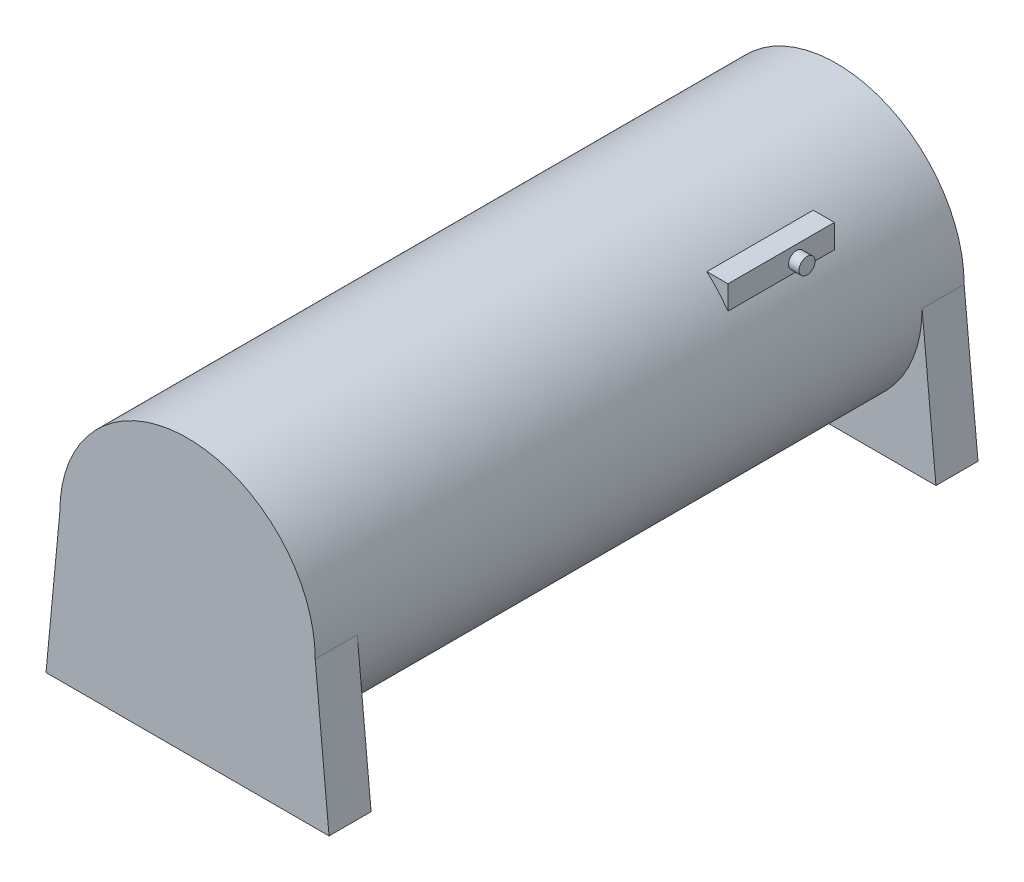
ISO-10303-21;
HEADER;
FILE_DESCRIPTION(('STEP AP214'),'2;1');
FILE_NAME('part.step','',(''),(''),'','','');
FILE_SCHEMA(('AUTOMOTIVE_DESIGN { 1 0 10303 214 1 1 1 1 }'));
ENDSEC;
DATA;
#1=APPLICATION_CONTEXT('core data for automotive mechanical design processes');
#2=APPLICATION_PROTOCOL_DEFINITION('international standard','automotive_design',2000,#1);
#3=PRODUCT_CONTEXT('',#1,'mechanical');
#4=PRODUCT('Part','Part','',(#3));
#5=PRODUCT_RELATED_PRODUCT_CATEGORY('part','',(#4));
#6=PRODUCT_DEFINITION_FORMATION('','',#4);
#7=PRODUCT_DEFINITION_CONTEXT('part definition',#1,'design');
#8=PRODUCT_DEFINITION('design','',#6,#7);
#9=PRODUCT_DEFINITION_SHAPE('','',#8);
#10=(LENGTH_UNIT() NAMED_UNIT(*) SI_UNIT(.MILLI.,.METRE.));
#11=(NAMED_UNIT(*) PLANE_ANGLE_UNIT() SI_UNIT($,.RADIAN.));
#12=(NAMED_UNIT(*) SI_UNIT($,.STERADIAN.) SOLID_ANGLE_UNIT());
#13=UNCERTAINTY_MEASURE_WITH_UNIT(LENGTH_MEASURE(1.E-05),#10,'distance_accuracy_value','');
#14=(GEOMETRIC_REPRESENTATION_CONTEXT(3) GLOBAL_UNCERTAINTY_ASSIGNED_CONTEXT((#13)) GLOBAL_UNIT_ASSIGNED_CONTEXT((#10,
#11,#12)) REPRESENTATION_CONTEXT('',''));
#15=CARTESIAN_POINT('',(0.,0.,0.));
#16=DIRECTION('',(0.,0.,1.));
#17=DIRECTION('',(1.,0.,0.));
#18=AXIS2_PLACEMENT_3D('',#15,#16,#17);
#19=CARTESIAN_POINT('',(0.,0.,308.6));
#20=DIRECTION('',(0.,0.,-1.));
#21=DIRECTION('',(-1.,0.,0.));
#22=AXIS2_PLACEMENT_3D('',#19,#20,#21);
#23=CYLINDRICAL_SURFACE('',#22,60.72);
#24=DIRECTION('',(0.,0.,-1.));
#25=VECTOR('',#24,1.);
#26=CARTESIAN_POINT('',(50.,34.4516821069741,308.6));
#27=LINE('',#26,#25);
#28=CARTESIAN_POINT('',(50.,34.4516821069741,51.));
#29=VERTEX_POINT('',#28);
#30=CARTESIAN_POINT('',(50.,34.4516821069741,101.6));
#31=VERTEX_POINT('',#30);
#32=EDGE_CURVE('E139',#29,#31,#27,.F.);
#33=ORIENTED_EDGE('',*,*,#32,.T.);
#34=CARTESIAN_POINT('',(0.,0.,101.6));
#35=DIRECTION('',(0.,0.,1.));
#36=DIRECTION('',(1.,0.,0.));
#37=AXIS2_PLACEMENT_3D('',#34,#35,#36);
#38=CIRCLE('',#37,60.72);
#39=CARTESIAN_POINT('',(39.9574773978538,45.72,101.6));
#40=VERTEX_POINT('',#39);
#41=EDGE_CURVE('E11',#31,#40,#38,.T.);
#42=ORIENTED_EDGE('',*,*,#41,.T.);
#43=DIRECTION('',(0.,0.,-1.));
#44=VECTOR('',#43,1.);
#45=CARTESIAN_POINT('',(39.9574773978538,45.72,308.6));
#46=LINE('',#45,#44);
#47=CARTESIAN_POINT('',(39.9574773978538,45.72,51.));
#48=VERTEX_POINT('',#47);
#49=EDGE_CURVE('E47',#40,#48,#46,.T.);
#50=ORIENTED_EDGE('',*,*,#49,.T.);
#51=CARTESIAN_POINT('',(0.,0.,51.));
#52=DIRECTION('',(0.,0.,-1.));
#53=DIRECTION('',(0.,1.,0.));
#54=AXIS2_PLACEMENT_3D('',#51,#52,#53);
#55=CIRCLE('',#54,60.72);
#56=EDGE_CURVE('E129',#48,#29,#55,.T.);
#57=ORIENTED_EDGE('',*,*,#56,.T.);
#58=EDGE_LOOP('',(#33,#42,#50,#57));
#59=FACE_BOUND('',#58,.T.);
#60=CARTESIAN_POINT('',(0.,0.,308.6));
#61=DIRECTION('',(0.,0.,1.));
#62=DIRECTION('',(1.,0.,0.));
#63=AXIS2_PLACEMENT_3D('',#60,#61,#62);
#64=CIRCLE('',#63,60.72);
#65=CARTESIAN_POINT('',(60.72,0.,308.6));
#66=VERTEX_POINT('',#65);
#67=CARTESIAN_POINT('',(-60.72,0.,308.6));
#68=VERTEX_POINT('',#67);
#69=EDGE_CURVE('E225',#66,#68,#64,.T.);
#70=ORIENTED_EDGE('',*,*,#69,.F.);
#71=DIRECTION('',(0.,0.,1.));
#72=VECTOR('',#71,1.);
#73=CARTESIAN_POINT('',(60.72,0.,288.6));
#74=LINE('',#73,#72);
#75=CARTESIAN_POINT('',(60.72,0.,288.6));
#76=VERTEX_POINT('',#75);
#77=EDGE_CURVE('E201',#76,#66,#74,.T.);
#78=ORIENTED_EDGE('',*,*,#77,.F.);
#79=CARTESIAN_POINT('',(0.,0.,288.6));
#80=DIRECTION('',(0.,0.,-1.));
#81=DIRECTION('',(-1.,0.,0.));
#82=AXIS2_PLACEMENT_3D('',#79,#80,#81);
#83=CIRCLE('',#82,60.72);
#84=CARTESIAN_POINT('',(-60.72,0.,288.6));
#85=VERTEX_POINT('',#84);
#86=EDGE_CURVE('E229',#76,#85,#83,.T.);
#87=ORIENTED_EDGE('',*,*,#86,.T.);
#88=DIRECTION('',(0.,0.,1.));
#89=VECTOR('',#88,1.);
#90=CARTESIAN_POINT('',(-60.72,0.,288.6));
#91=LINE('',#90,#89);
#92=EDGE_CURVE('E218',#85,#68,#91,.T.);
#93=ORIENTED_EDGE('',*,*,#92,.T.);
#94=EDGE_LOOP('',(#70,#78,#87,#93));
#95=FACE_BOUND('',#94,.T.);
#96=CARTESIAN_POINT('',(0.,0.,20.));
#97=DIRECTION('',(0.,0.,1.));
#98=DIRECTION('',(1.,0.,0.));
#99=AXIS2_PLACEMENT_3D('',#96,#97,#98);
#100=CIRCLE('',#99,60.72);
#101=CARTESIAN_POINT('',(-60.72,0.,20.));
#102=VERTEX_POINT('',#101);
#103=CARTESIAN_POINT('',(60.72,0.,20.));
#104=VERTEX_POINT('',#103);
#105=EDGE_CURVE('E62',#102,#104,#100,.T.);
#106=ORIENTED_EDGE('',*,*,#105,.T.);
#107=DIRECTION('',(0.,0.,-1.));
#108=VECTOR('',#107,1.);
#109=CARTESIAN_POINT('',(60.72,0.,20.));
#110=LINE('',#109,#108);
#111=CARTESIAN_POINT('',(60.72,0.,0.));
#112=VERTEX_POINT('',#111);
#113=EDGE_CURVE('E178',#104,#112,#110,.T.);
#114=ORIENTED_EDGE('',*,*,#113,.T.);
#115=CARTESIAN_POINT('',(0.,0.,0.));
#116=DIRECTION('',(0.,0.,1.));
#117=DIRECTION('',(1.,0.,0.));
#118=AXIS2_PLACEMENT_3D('',#115,#116,#117);
#119=CIRCLE('',#118,60.72);
#120=CARTESIAN_POINT('',(-60.72,0.,0.));
#121=VERTEX_POINT('',#120);
#122=EDGE_CURVE('E214',#112,#121,#119,.T.);
#123=ORIENTED_EDGE('',*,*,#122,.T.);
#124=DIRECTION('',(0.,0.,-1.));
#125=VECTOR('',#124,1.);
#126=CARTESIAN_POINT('',(-60.72,0.,20.));
#127=LINE('',#126,#125);
#128=EDGE_CURVE('E181',#102,#121,#127,.T.);
#129=ORIENTED_EDGE('',*,*,#128,.F.);
#130=EDGE_LOOP('',(#106,#114,#123,#129));
#131=FACE_BOUND('',#130,.T.);
#132=ADVANCED_FACE('F39',(#59,#95,#131),#23,.T.);
#133=CARTESIAN_POINT('',(0.,0.,308.6));
#134=DIRECTION('',(0.,0.,1.));
#135=DIRECTION('',(1.,0.,0.));
#136=AXIS2_PLACEMENT_3D('',#133,#134,#135);
#137=PLANE('',#136);
#138=ORIENTED_EDGE('',*,*,#69,.T.);
#139=DIRECTION('',(-0.0942381281547302,-0.995549684948919,0.));
#140=VECTOR('',#139,1.);
#141=CARTESIAN_POINT('',(-67.3,-69.5123837371664,308.6));
#142=LINE('',#141,#140);
#143=CARTESIAN_POINT('',(-67.3,-69.5123837371664,308.6));
#144=VERTEX_POINT('',#143);
#145=EDGE_CURVE('E204',#68,#144,#142,.T.);
#146=ORIENTED_EDGE('',*,*,#145,.T.);
#147=DIRECTION('',(1.,0.,0.));
#148=VECTOR('',#147,1.);
#149=CARTESIAN_POINT('',(67.3,-69.5123837371664,308.6));
#150=LINE('',#149,#148);
#151=CARTESIAN_POINT('',(67.3,-69.5123837371664,308.6));
#152=VERTEX_POINT('',#151);
#153=EDGE_CURVE('E193',#144,#152,#150,.T.);
#154=ORIENTED_EDGE('',*,*,#153,.T.);
#155=DIRECTION('',(-0.0942381281547302,0.995549684948919,0.));
#156=VECTOR('',#155,1.);
#157=CARTESIAN_POINT('',(67.3,-69.5123837371664,308.6));
#158=LINE('',#157,#156);
#159=EDGE_CURVE('E177',#152,#66,#158,.T.);
#160=ORIENTED_EDGE('',*,*,#159,.T.);
#161=EDGE_LOOP('',(#138,#146,#154,#160));
#162=FACE_BOUND('',#161,.T.);
#163=ADVANCED_FACE('F269',(#162),#137,.T.);
#164=CARTESIAN_POINT('',(0.,0.,0.));
#165=DIRECTION('',(0.,0.,1.));
#166=DIRECTION('',(1.,0.,0.));
#167=AXIS2_PLACEMENT_3D('',#164,#165,#166);
#168=PLANE('',#167);
#169=ORIENTED_EDGE('',*,*,#122,.F.);
#170=DIRECTION('',(0.0942381281547302,-0.995549684948919,0.));
#171=VECTOR('',#170,1.);
#172=CARTESIAN_POINT('',(67.3,-69.5123837371664,0.));
#173=LINE('',#172,#171);
#174=CARTESIAN_POINT('',(67.3,-69.5123837371664,0.));
#175=VERTEX_POINT('',#174);
#176=EDGE_CURVE('E168',#112,#175,#173,.T.);
#177=ORIENTED_EDGE('',*,*,#176,.T.);
#178=DIRECTION('',(-1.,0.,0.));
#179=VECTOR('',#178,1.);
#180=CARTESIAN_POINT('',(-2.23697042273013,-69.5123837371664,0.));
#181=LINE('',#180,#179);
#182=CARTESIAN_POINT('',(-67.3,-69.5123837371664,0.));
#183=VERTEX_POINT('',#182);
#184=EDGE_CURVE('E156',#175,#183,#181,.T.);
#185=ORIENTED_EDGE('',*,*,#184,.T.);
#186=DIRECTION('',(0.0942381281547302,0.995549684948919,0.));
#187=VECTOR('',#186,1.);
#188=CARTESIAN_POINT('',(-60.72,0.,0.));
#189=LINE('',#188,#187);
#190=EDGE_CURVE('E149',#183,#121,#189,.T.);
#191=ORIENTED_EDGE('',*,*,#190,.T.);
#192=EDGE_LOOP('',(#169,#177,#185,#191));
#193=FACE_BOUND('',#192,.T.);
#194=ADVANCED_FACE('F273',(#193),#168,.F.);
#195=CARTESIAN_POINT('',(67.3,-69.5123837371664,288.6));
#196=DIRECTION('',(0.995549684948919,0.0942381281547302,0.));
#197=DIRECTION('',(-0.0942381281547302,0.995549684948919,0.));
#198=AXIS2_PLACEMENT_3D('',#195,#196,#197);
#199=PLANE('',#198);
#200=ORIENTED_EDGE('',*,*,#159,.F.);
#201=DIRECTION('',(0.,0.,1.));
#202=VECTOR('',#201,1.);
#203=CARTESIAN_POINT('',(67.3,-69.5123837371664,288.6));
#204=LINE('',#203,#202);
#205=CARTESIAN_POINT('',(67.3,-69.5123837371664,288.6));
#206=VERTEX_POINT('',#205);
#207=EDGE_CURVE('E211',#206,#152,#204,.T.);
#208=ORIENTED_EDGE('',*,*,#207,.F.);
#209=DIRECTION('',(-0.0942381281547302,0.995549684948919,0.));
#210=VECTOR('',#209,1.);
#211=CARTESIAN_POINT('',(67.3,-69.5123837371664,288.6));
#212=LINE('',#211,#210);
#213=EDGE_CURVE('E188',#206,#76,#212,.T.);
#214=ORIENTED_EDGE('',*,*,#213,.T.);
#215=ORIENTED_EDGE('',*,*,#77,.T.);
#216=EDGE_LOOP('',(#200,#208,#214,#215));
#217=FACE_BOUND('',#216,.T.);
#218=ADVANCED_FACE('F279',(#217),#199,.T.);
#219=CARTESIAN_POINT('',(67.3,-69.5123837371664,288.6));
#220=DIRECTION('',(0.,-1.,0.));
#221=DIRECTION('',(0.,0.,-1.));
#222=AXIS2_PLACEMENT_3D('',#219,#220,#221);
#223=PLANE('',#222);
#224=ORIENTED_EDGE('',*,*,#153,.F.);
#225=DIRECTION('',(0.,0.,1.));
#226=VECTOR('',#225,1.);
#227=CARTESIAN_POINT('',(-67.3,-69.5123837371664,288.6));
#228=LINE('',#227,#226);
#229=CARTESIAN_POINT('',(-67.3,-69.5123837371664,288.6));
#230=VERTEX_POINT('',#229);
#231=EDGE_CURVE('E215',#230,#144,#228,.T.);
#232=ORIENTED_EDGE('',*,*,#231,.F.);
#233=DIRECTION('',(1.,0.,0.));
#234=VECTOR('',#233,1.);
#235=CARTESIAN_POINT('',(67.3,-69.5123837371664,288.6));
#236=LINE('',#235,#234);
#237=EDGE_CURVE('E197',#230,#206,#236,.T.);
#238=ORIENTED_EDGE('',*,*,#237,.T.);
#239=ORIENTED_EDGE('',*,*,#207,.T.);
#240=EDGE_LOOP('',(#224,#232,#238,#239));
#241=FACE_BOUND('',#240,.T.);
#242=ADVANCED_FACE('F284',(#241),#223,.T.);
#243=CARTESIAN_POINT('',(-67.3,-69.5123837371664,288.6));
#244=DIRECTION('',(-0.995549684948919,0.0942381281547302,0.));
#245=DIRECTION('',(-0.0942381281547302,-0.995549684948919,0.));
#246=AXIS2_PLACEMENT_3D('',#243,#244,#245);
#247=PLANE('',#246);
#248=ORIENTED_EDGE('',*,*,#145,.F.);
#249=ORIENTED_EDGE('',*,*,#92,.F.);
#250=DIRECTION('',(-0.0942381281547302,-0.995549684948919,0.));
#251=VECTOR('',#250,1.);
#252=CARTESIAN_POINT('',(-67.3,-69.5123837371664,288.6));
#253=LINE('',#252,#251);
#254=EDGE_CURVE('E192',#85,#230,#253,.T.);
#255=ORIENTED_EDGE('',*,*,#254,.T.);
#256=ORIENTED_EDGE('',*,*,#231,.T.);
#257=EDGE_LOOP('',(#248,#249,#255,#256));
#258=FACE_BOUND('',#257,.T.);
#259=ADVANCED_FACE('F286',(#258),#247,.T.);
#260=CARTESIAN_POINT('',(0.,0.,288.6));
#261=DIRECTION('',(0.,0.,-1.));
#262=DIRECTION('',(-1.,0.,0.));
#263=AXIS2_PLACEMENT_3D('',#260,#261,#262);
#264=PLANE('',#263);
#265=ORIENTED_EDGE('',*,*,#86,.F.);
#266=ORIENTED_EDGE('',*,*,#213,.F.);
#267=ORIENTED_EDGE('',*,*,#237,.F.);
#268=ORIENTED_EDGE('',*,*,#254,.F.);
#269=EDGE_LOOP('',(#265,#266,#267,#268));
#270=FACE_BOUND('',#269,.T.);
#271=ADVANCED_FACE('F289',(#270),#264,.T.);
#272=CARTESIAN_POINT('',(-2.23697042273013,-69.5123837371664,20.));
#273=DIRECTION('',(0.,-1.,0.));
#274=DIRECTION('',(0.,0.,-1.));
#275=AXIS2_PLACEMENT_3D('',#272,#273,#274);
#276=PLANE('',#275);
#277=ORIENTED_EDGE('',*,*,#184,.F.);
#278=DIRECTION('',(0.,0.,-1.));
#279=VECTOR('',#278,1.);
#280=CARTESIAN_POINT('',(67.3,-69.5123837371664,20.));
#281=LINE('',#280,#279);
#282=CARTESIAN_POINT('',(67.3,-69.5123837371664,20.));
#283=VERTEX_POINT('',#282);
#284=EDGE_CURVE('E174',#283,#175,#281,.T.);
#285=ORIENTED_EDGE('',*,*,#284,.F.);
#286=DIRECTION('',(-1.,0.,0.));
#287=VECTOR('',#286,1.);
#288=CARTESIAN_POINT('',(-67.3,-69.5123837371664,20.));
#289=LINE('',#288,#287);
#290=CARTESIAN_POINT('',(-67.3,-69.5123837371664,20.));
#291=VERTEX_POINT('',#290);
#292=EDGE_CURVE('E151',#283,#291,#289,.T.);
#293=ORIENTED_EDGE('',*,*,#292,.T.);
#294=DIRECTION('',(0.,0.,-1.));
#295=VECTOR('',#294,1.);
#296=CARTESIAN_POINT('',(-67.3,-69.5123837371664,20.));
#297=LINE('',#296,#295);
#298=EDGE_CURVE('E164',#291,#183,#297,.T.);
#299=ORIENTED_EDGE('',*,*,#298,.T.);
#300=EDGE_LOOP('',(#277,#285,#293,#299));
#301=FACE_BOUND('',#300,.T.);
#302=ADVANCED_FACE('F296',(#301),#276,.T.);
#303=CARTESIAN_POINT('',(67.3,-69.5123837371664,20.));
#304=DIRECTION('',(0.995549684948919,0.0942381281547302,0.));
#305=DIRECTION('',(-0.0942381281547302,0.995549684948919,0.));
#306=AXIS2_PLACEMENT_3D('',#303,#304,#305);
#307=PLANE('',#306);
#308=ORIENTED_EDGE('',*,*,#176,.F.);
#309=ORIENTED_EDGE('',*,*,#113,.F.);
#310=DIRECTION('',(0.0942381281547302,-0.995549684948919,0.));
#311=VECTOR('',#310,1.);
#312=CARTESIAN_POINT('',(67.3,-69.5123837371664,20.));
#313=LINE('',#312,#311);
#314=EDGE_CURVE('E160',#104,#283,#313,.T.);
#315=ORIENTED_EDGE('',*,*,#314,.T.);
#316=ORIENTED_EDGE('',*,*,#284,.T.);
#317=EDGE_LOOP('',(#308,#309,#315,#316));
#318=FACE_BOUND('',#317,.T.);
#319=ADVANCED_FACE('F301',(#318),#307,.T.);
#320=CARTESIAN_POINT('',(-60.72,0.,20.));
#321=DIRECTION('',(-0.995549684948919,0.0942381281547302,0.));
#322=DIRECTION('',(-0.0942381281547302,-0.995549684948919,0.));
#323=AXIS2_PLACEMENT_3D('',#320,#321,#322);
#324=PLANE('',#323);
#325=ORIENTED_EDGE('',*,*,#190,.F.);
#326=ORIENTED_EDGE('',*,*,#298,.F.);
#327=DIRECTION('',(0.0942381281547302,0.995549684948919,0.));
#328=VECTOR('',#327,1.);
#329=CARTESIAN_POINT('',(-60.72,0.,20.));
#330=LINE('',#329,#328);
#331=EDGE_CURVE('E155',#291,#102,#330,.T.);
#332=ORIENTED_EDGE('',*,*,#331,.T.);
#333=ORIENTED_EDGE('',*,*,#128,.T.);
#334=EDGE_LOOP('',(#325,#326,#332,#333));
#335=FACE_BOUND('',#334,.T.);
#336=ADVANCED_FACE('F298',(#335),#324,.T.);
#337=CARTESIAN_POINT('',(0.,0.,20.));
#338=DIRECTION('',(0.,0.,1.));
#339=DIRECTION('',(1.,0.,0.));
#340=AXIS2_PLACEMENT_3D('',#337,#338,#339);
#341=PLANE('',#340);
#342=ORIENTED_EDGE('',*,*,#105,.F.);
#343=ORIENTED_EDGE('',*,*,#331,.F.);
#344=ORIENTED_EDGE('',*,*,#292,.F.);
#345=ORIENTED_EDGE('',*,*,#314,.F.);
#346=EDGE_LOOP('',(#342,#343,#344,#345));
#347=FACE_BOUND('',#346,.T.);
#348=ADVANCED_FACE('F265',(#347),#341,.T.);
#349=CARTESIAN_POINT('',(30.,45.72,101.6));
#350=DIRECTION('',(0.,1.,0.));
#351=DIRECTION('',(0.,0.,1.));
#352=AXIS2_PLACEMENT_3D('',#349,#350,#351);
#353=PLANE('',#352);
#354=ORIENTED_EDGE('',*,*,#49,.F.);
#355=DIRECTION('',(1.,0.,0.));
#356=VECTOR('',#355,1.);
#357=CARTESIAN_POINT('',(30.,45.72,101.6));
#358=LINE('',#357,#356);
#359=CARTESIAN_POINT('',(50.,45.72,101.6));
#360=VERTEX_POINT('',#359);
#361=EDGE_CURVE('E134',#40,#360,#358,.T.);
#362=ORIENTED_EDGE('',*,*,#361,.T.);
#363=DIRECTION('',(0.,0.,1.));
#364=VECTOR('',#363,1.);
#365=CARTESIAN_POINT('',(50.,45.72,101.6));
#366=LINE('',#365,#364);
#367=CARTESIAN_POINT('',(50.,45.72,51.));
#368=VERTEX_POINT('',#367);
#369=EDGE_CURVE('E135',#368,#360,#366,.T.);
#370=ORIENTED_EDGE('',*,*,#369,.F.);
#371=DIRECTION('',(1.,0.,0.));
#372=VECTOR('',#371,1.);
#373=CARTESIAN_POINT('',(30.,45.72,51.));
#374=LINE('',#373,#372);
#375=EDGE_CURVE('E124',#48,#368,#374,.T.);
#376=ORIENTED_EDGE('',*,*,#375,.F.);
#377=EDGE_LOOP('',(#354,#362,#370,#376));
#378=FACE_BOUND('',#377,.T.);
#379=ADVANCED_FACE('F142',(#378),#353,.T.);
#380=CARTESIAN_POINT('',(50.,0.,0.));
#381=DIRECTION('',(1.,0.,0.));
#382=DIRECTION('',(0.,0.,-1.));
#383=AXIS2_PLACEMENT_3D('',#380,#381,#382);
#384=PLANE('',#383);
#385=CARTESIAN_POINT('',(50.,39.37,69.));
#386=DIRECTION('',(1.,0.,0.));
#387=DIRECTION('',(0.,0.,-1.));
#388=AXIS2_PLACEMENT_3D('',#385,#386,#387);
#389=CIRCLE('',#388,3.8);
#390=CARTESIAN_POINT('',(50.,39.37,65.2));
#391=VERTEX_POINT('',#390);
#392=EDGE_CURVE('E249',#391,#391,#389,.T.);
#393=ORIENTED_EDGE('',*,*,#392,.F.);
#394=EDGE_LOOP('',(#393));
#395=FACE_BOUND('',#394,.T.);
#396=ORIENTED_EDGE('',*,*,#32,.F.);
#397=DIRECTION('',(0.,1.,0.));
#398=VECTOR('',#397,1.);
#399=CARTESIAN_POINT('',(50.,45.72,51.));
#400=LINE('',#399,#398);
#401=EDGE_CURVE('E127',#29,#368,#400,.T.);
#402=ORIENTED_EDGE('',*,*,#401,.T.);
#403=ORIENTED_EDGE('',*,*,#369,.T.);
#404=DIRECTION('',(0.,-1.,0.));
#405=VECTOR('',#404,1.);
#406=CARTESIAN_POINT('',(50.,45.72,101.6));
#407=LINE('',#406,#405);
#408=EDGE_CURVE('E54',#360,#31,#407,.T.);
#409=ORIENTED_EDGE('',*,*,#408,.T.);
#410=EDGE_LOOP('',(#396,#402,#403,#409));
#411=FACE_BOUND('',#410,.T.);
#412=ADVANCED_FACE('F137',(#395,#411),#384,.T.);
#413=CARTESIAN_POINT('',(30.,45.72,101.6));
#414=DIRECTION('',(0.,0.,1.));
#415=DIRECTION('',(1.,0.,0.));
#416=AXIS2_PLACEMENT_3D('',#413,#414,#415);
#417=PLANE('',#416);
#418=ORIENTED_EDGE('',*,*,#41,.F.);
#419=ORIENTED_EDGE('',*,*,#408,.F.);
#420=ORIENTED_EDGE('',*,*,#361,.F.);
#421=EDGE_LOOP('',(#418,#419,#420));
#422=FACE_BOUND('',#421,.T.);
#423=ADVANCED_FACE('F244',(#422),#417,.T.);
#424=CARTESIAN_POINT('',(30.,45.72,51.));
#425=DIRECTION('',(0.,0.,-1.));
#426=DIRECTION('',(0.,1.,0.));
#427=AXIS2_PLACEMENT_3D('',#424,#425,#426);
#428=PLANE('',#427);
#429=ORIENTED_EDGE('',*,*,#56,.F.);
#430=ORIENTED_EDGE('',*,*,#375,.T.);
#431=ORIENTED_EDGE('',*,*,#401,.F.);
#432=EDGE_LOOP('',(#429,#430,#431));
#433=FACE_BOUND('',#432,.T.);
#434=ADVANCED_FACE('F126',(#433),#428,.T.);
#435=CARTESIAN_POINT('',(55.,39.37,69.));
#436=DIRECTION('',(-1.,0.,0.));
#437=DIRECTION('',(0.,0.,1.));
#438=AXIS2_PLACEMENT_3D('',#435,#436,#437);
#439=CYLINDRICAL_SURFACE('',#438,3.8);
#440=CARTESIAN_POINT('',(55.,39.37,69.));
#441=DIRECTION('',(1.,0.,0.));
#442=DIRECTION('',(0.,0.,-1.));
#443=AXIS2_PLACEMENT_3D('',#440,#441,#442);
#444=CIRCLE('',#443,3.8);
#445=CARTESIAN_POINT('',(55.,39.37,65.2));
#446=VERTEX_POINT('',#445);
#447=EDGE_CURVE('E246',#446,#446,#444,.T.);
#448=ORIENTED_EDGE('',*,*,#447,.F.);
#449=EDGE_LOOP('',(#448));
#450=FACE_BOUND('',#449,.T.);
#451=ORIENTED_EDGE('',*,*,#392,.T.);
#452=EDGE_LOOP('',(#451));
#453=FACE_BOUND('',#452,.T.);
#454=ADVANCED_FACE('F256',(#450,#453),#439,.T.);
#455=CARTESIAN_POINT('',(55.,39.37,69.));
#456=DIRECTION('',(1.,0.,0.));
#457=DIRECTION('',(0.,0.,-1.));
#458=AXIS2_PLACEMENT_3D('',#455,#456,#457);
#459=PLANE('',#458);
#460=ORIENTED_EDGE('',*,*,#447,.T.);
#461=EDGE_LOOP('',(#460));
#462=FACE_BOUND('',#461,.T.);
#463=ADVANCED_FACE('F316',(#462),#459,.T.);
#464=CLOSED_SHELL('',(#132,#163,#194,#218,#242,#259,#271,#302,#319,#336,#348,#379,#412,#423,
#434,#454,#463));
#465=MANIFOLD_SOLID_BREP('B2',#464);
#466=ADVANCED_BREP_SHAPE_REPRESENTATION('',(#18,#465),#14);
#467=SHAPE_DEFINITION_REPRESENTATION(#9,#466);
ENDSEC;
END-ISO-10303-21;
